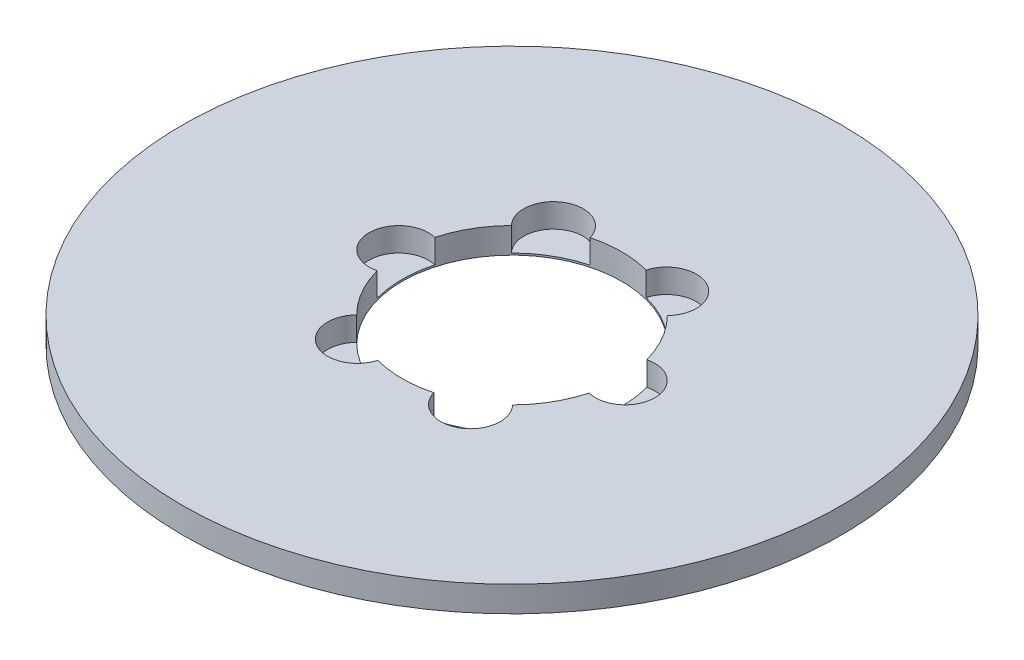
ISO-10303-21;
HEADER;
FILE_DESCRIPTION(('STEP AP214'),'2;1');
FILE_NAME('part.step','',(''),(''),'','','');
FILE_SCHEMA(('AUTOMOTIVE_DESIGN { 1 0 10303 214 1 1 1 1 }'));
ENDSEC;
DATA;
#1=APPLICATION_CONTEXT('core data for automotive mechanical design processes');
#2=APPLICATION_PROTOCOL_DEFINITION('international standard','automotive_design',2000,#1);
#3=PRODUCT_CONTEXT('',#1,'mechanical');
#4=PRODUCT('Part','Part','',(#3));
#5=PRODUCT_RELATED_PRODUCT_CATEGORY('part','',(#4));
#6=PRODUCT_DEFINITION_FORMATION('','',#4);
#7=PRODUCT_DEFINITION_CONTEXT('part definition',#1,'design');
#8=PRODUCT_DEFINITION('design','',#6,#7);
#9=PRODUCT_DEFINITION_SHAPE('','',#8);
#10=(LENGTH_UNIT() NAMED_UNIT(*) SI_UNIT(.MILLI.,.METRE.));
#11=(NAMED_UNIT(*) PLANE_ANGLE_UNIT() SI_UNIT($,.RADIAN.));
#12=(NAMED_UNIT(*) SI_UNIT($,.STERADIAN.) SOLID_ANGLE_UNIT());
#13=UNCERTAINTY_MEASURE_WITH_UNIT(LENGTH_MEASURE(1.E-05),#10,'distance_accuracy_value','');
#14=(GEOMETRIC_REPRESENTATION_CONTEXT(3) GLOBAL_UNCERTAINTY_ASSIGNED_CONTEXT((#13)) GLOBAL_UNIT_ASSIGNED_CONTEXT((#10,
#11,#12)) REPRESENTATION_CONTEXT('',''));
#15=CARTESIAN_POINT('',(0.,0.,0.));
#16=DIRECTION('',(0.,0.,1.));
#17=DIRECTION('',(1.,0.,0.));
#18=AXIS2_PLACEMENT_3D('',#15,#16,#17);
#19=CARTESIAN_POINT('',(0.,7.,0.));
#20=DIRECTION('',(0.,-1.,0.));
#21=DIRECTION('',(0.,0.,-1.));
#22=AXIS2_PLACEMENT_3D('',#19,#20,#21);
#23=CYLINDRICAL_SURFACE('',#22,90.);
#24=CARTESIAN_POINT('',(0.,7.,0.));
#25=DIRECTION('',(0.,1.,0.));
#26=DIRECTION('',(0.,0.,1.));
#27=AXIS2_PLACEMENT_3D('',#24,#25,#26);
#28=CIRCLE('',#27,90.);
#29=CARTESIAN_POINT('',(0.,7.,90.));
#30=VERTEX_POINT('',#29);
#31=EDGE_CURVE('E171',#30,#30,#28,.T.);
#32=ORIENTED_EDGE('',*,*,#31,.F.);
#33=EDGE_LOOP('',(#32));
#34=FACE_BOUND('',#33,.T.);
#35=CARTESIAN_POINT('',(0.,0.,0.));
#36=DIRECTION('',(0.,1.,0.));
#37=DIRECTION('',(0.,0.,1.));
#38=AXIS2_PLACEMENT_3D('',#35,#36,#37);
#39=CIRCLE('',#38,90.);
#40=CARTESIAN_POINT('',(0.,0.,90.));
#41=VERTEX_POINT('',#40);
#42=EDGE_CURVE('E157',#41,#41,#39,.T.);
#43=ORIENTED_EDGE('',*,*,#42,.T.);
#44=EDGE_LOOP('',(#43));
#45=FACE_BOUND('',#44,.T.);
#46=ADVANCED_FACE('F39',(#34,#45),#23,.T.);
#47=CARTESIAN_POINT('',(0.,7.,0.));
#48=DIRECTION('',(0.,1.,0.));
#49=DIRECTION('',(0.,0.,1.));
#50=AXIS2_PLACEMENT_3D('',#47,#48,#49);
#51=PLANE('',#50);
#52=CARTESIAN_POINT('',(-15.4615850806453,7.,-26.7802509252258));
#53=DIRECTION('',(0.,1.,0.));
#54=DIRECTION('',(-0.866025403784433,0.,0.50000000000001));
#55=AXIS2_PLACEMENT_3D('',#52,#53,#54);
#56=CIRCLE('',#55,8.11786884203244);
#57=CARTESIAN_POINT('',(-7.65505944737844,7.,-29.0068968498373));
#58=VERTEX_POINT('',#57);
#59=CARTESIAN_POINT('',(-21.2931798332252,7.,-21.132924373828));
#60=VERTEX_POINT('',#59);
#61=EDGE_CURVE('E214',#58,#60,#56,.T.);
#62=ORIENTED_EDGE('',*,*,#61,.F.);
#63=CARTESIAN_POINT('',(0.,7.,0.));
#64=DIRECTION('',(0.,1.,0.));
#65=DIRECTION('',(0.,0.,1.));
#66=AXIS2_PLACEMENT_3D('',#63,#64,#65);
#67=CIRCLE('',#66,30.);
#68=CARTESIAN_POINT('',(7.65505944737783,7.,-29.0068968498375));
#69=VERTEX_POINT('',#68);
#70=EDGE_CURVE('E272',#69,#58,#67,.T.);
#71=ORIENTED_EDGE('',*,*,#70,.F.);
#72=CARTESIAN_POINT('',(15.4615850806447,7.,-26.7802509252261));
#73=DIRECTION('',(0.,1.,0.));
#74=DIRECTION('',(-0.866025403784443,0.,-0.499999999999992));
#75=AXIS2_PLACEMENT_3D('',#72,#73,#74);
#76=CIRCLE('',#75,8.11786884203244);
#77=CARTESIAN_POINT('',(21.2931798332248,7.,-21.1329243738284));
#78=VERTEX_POINT('',#77);
#79=EDGE_CURVE('E285',#78,#69,#76,.T.);
#80=ORIENTED_EDGE('',*,*,#79,.F.);
#81=CARTESIAN_POINT('',(28.9482392806031,7.,-7.8739724760092));
#82=VERTEX_POINT('',#81);
#83=EDGE_CURVE('E165',#82,#78,#67,.T.);
#84=ORIENTED_EDGE('',*,*,#83,.F.);
#85=CARTESIAN_POINT('',(30.9231701612899,7.,0.));
#86=DIRECTION('',(0.,1.,0.));
#87=DIRECTION('',(0.,0.,-1.));
#88=AXIS2_PLACEMENT_3D('',#85,#86,#87);
#89=CIRCLE('',#88,8.11786884203244);
#90=CARTESIAN_POINT('',(28.9482392806031,7.,7.8739724760092));
#91=VERTEX_POINT('',#90);
#92=EDGE_CURVE('E281',#91,#82,#89,.T.);
#93=ORIENTED_EDGE('',*,*,#92,.F.);
#94=CARTESIAN_POINT('',(21.293179833225,7.,21.1329243738281));
#95=VERTEX_POINT('',#94);
#96=EDGE_CURVE('E160',#95,#91,#67,.T.);
#97=ORIENTED_EDGE('',*,*,#96,.F.);
#98=CARTESIAN_POINT('',(15.4615850806451,7.,26.7802509252259));
#99=DIRECTION('',(0.,1.,0.));
#100=DIRECTION('',(0.866025403784436,0.,-0.500000000000004));
#101=AXIS2_PLACEMENT_3D('',#98,#99,#100);
#102=CIRCLE('',#101,8.11786884203244);
#103=CARTESIAN_POINT('',(7.65505944737824,7.,29.0068968498374));
#104=VERTEX_POINT('',#103);
#105=EDGE_CURVE('E154',#104,#95,#102,.T.);
#106=ORIENTED_EDGE('',*,*,#105,.F.);
#107=CARTESIAN_POINT('',(-7.65505944737803,7.,29.0068968498374));
#108=VERTEX_POINT('',#107);
#109=EDGE_CURVE('E150',#108,#104,#67,.T.);
#110=ORIENTED_EDGE('',*,*,#109,.F.);
#111=CARTESIAN_POINT('',(-15.4615850806449,7.,26.780250925226));
#112=DIRECTION('',(0.,1.,0.));
#113=DIRECTION('',(0.86602540378444,0.,0.499999999999998));
#114=AXIS2_PLACEMENT_3D('',#111,#112,#113);
#115=CIRCLE('',#114,8.11786884203244);
#116=CARTESIAN_POINT('',(-21.2931798332249,7.,21.1329243738283));
#117=VERTEX_POINT('',#116);
#118=EDGE_CURVE('E127',#117,#108,#115,.T.);
#119=ORIENTED_EDGE('',*,*,#118,.F.);
#120=CARTESIAN_POINT('',(-28.9482392806031,7.,7.8739724760092));
#121=VERTEX_POINT('',#120);
#122=EDGE_CURVE('E156',#121,#117,#67,.T.);
#123=ORIENTED_EDGE('',*,*,#122,.F.);
#124=CARTESIAN_POINT('',(-30.9231701612899,7.,0.));
#125=DIRECTION('',(0.,1.,0.));
#126=DIRECTION('',(0.,0.,1.));
#127=AXIS2_PLACEMENT_3D('',#124,#125,#126);
#128=CIRCLE('',#127,8.11786884203244);
#129=CARTESIAN_POINT('',(-28.9482392806031,7.,-7.8739724760092));
#130=VERTEX_POINT('',#129);
#131=EDGE_CURVE('E164',#130,#121,#128,.T.);
#132=ORIENTED_EDGE('',*,*,#131,.F.);
#133=EDGE_CURVE('E159',#60,#130,#67,.T.);
#134=ORIENTED_EDGE('',*,*,#133,.F.);
#135=EDGE_LOOP('',(#62,#71,#80,#84,#93,#97,#106,#110,#119,#123,#132,#134));
#136=FACE_BOUND('',#135,.T.);
#137=ORIENTED_EDGE('',*,*,#31,.T.);
#138=EDGE_LOOP('',(#137));
#139=FACE_BOUND('',#138,.T.);
#140=ADVANCED_FACE('F155',(#136,#139),#51,.T.);
#141=CARTESIAN_POINT('',(0.,0.,0.));
#142=DIRECTION('',(0.,1.,0.));
#143=DIRECTION('',(0.,0.,1.));
#144=AXIS2_PLACEMENT_3D('',#141,#142,#143);
#145=PLANE('',#144);
#146=CARTESIAN_POINT('',(0.,0.,0.));
#147=DIRECTION('',(0.,1.,0.));
#148=DIRECTION('',(0.,0.,1.));
#149=AXIS2_PLACEMENT_3D('',#146,#147,#148);
#150=CIRCLE('',#149,30.);
#151=CARTESIAN_POINT('',(0.,0.,30.));
#152=VERTEX_POINT('',#151);
#153=EDGE_CURVE('E170',#152,#152,#150,.T.);
#154=ORIENTED_EDGE('',*,*,#153,.T.);
#155=EDGE_LOOP('',(#154));
#156=FACE_BOUND('',#155,.T.);
#157=ORIENTED_EDGE('',*,*,#42,.F.);
#158=EDGE_LOOP('',(#157));
#159=FACE_BOUND('',#158,.T.);
#160=ADVANCED_FACE('F232',(#156,#159),#145,.F.);
#161=CARTESIAN_POINT('',(0.,7.,0.));
#162=DIRECTION('',(0.,-1.,0.));
#163=DIRECTION('',(0.,0.,-1.));
#164=AXIS2_PLACEMENT_3D('',#161,#162,#163);
#165=CYLINDRICAL_SURFACE('',#164,30.);
#166=DIRECTION('',(0.,1.,0.));
#167=VECTOR('',#166,1.);
#168=CARTESIAN_POINT('',(-7.65505944737844,3.74736306349018,-29.0068968498373));
#169=LINE('',#168,#167);
#170=CARTESIAN_POINT('',(-7.65505944737844,0.494726126980354,-29.0068968498373));
#171=VERTEX_POINT('',#170);
#172=EDGE_CURVE('E11',#171,#58,#169,.T.);
#173=ORIENTED_EDGE('',*,*,#172,.F.);
#174=CARTESIAN_POINT('',(0.,0.494726126980354,0.));
#175=DIRECTION('',(0.,1.,0.));
#176=DIRECTION('',(0.,0.,1.));
#177=AXIS2_PLACEMENT_3D('',#174,#175,#176);
#178=CIRCLE('',#177,30.);
#179=CARTESIAN_POINT('',(-21.2931798332252,0.494726126980354,-21.132924373828));
#180=VERTEX_POINT('',#179);
#181=EDGE_CURVE('E209',#171,#180,#178,.T.);
#182=ORIENTED_EDGE('',*,*,#181,.T.);
#183=DIRECTION('',(0.,1.,0.));
#184=VECTOR('',#183,1.);
#185=CARTESIAN_POINT('',(-21.2931798332252,3.74736306349018,-21.132924373828));
#186=LINE('',#185,#184);
#187=EDGE_CURVE('E46',#60,#180,#186,.F.);
#188=ORIENTED_EDGE('',*,*,#187,.F.);
#189=ORIENTED_EDGE('',*,*,#133,.T.);
#190=DIRECTION('',(0.,1.,0.));
#191=VECTOR('',#190,1.);
#192=CARTESIAN_POINT('',(-28.9482392806031,3.74736306349018,-7.8739724760092));
#193=LINE('',#192,#191);
#194=CARTESIAN_POINT('',(-28.9482392806031,0.494726126980354,-7.8739724760092));
#195=VERTEX_POINT('',#194);
#196=EDGE_CURVE('E185',#195,#130,#193,.T.);
#197=ORIENTED_EDGE('',*,*,#196,.F.);
#198=CARTESIAN_POINT('',(0.,0.494726126980354,0.));
#199=DIRECTION('',(0.,1.,0.));
#200=DIRECTION('',(0.,0.,1.));
#201=AXIS2_PLACEMENT_3D('',#198,#199,#200);
#202=CIRCLE('',#201,30.);
#203=CARTESIAN_POINT('',(-28.9482392806031,0.494726126980354,7.8739724760092));
#204=VERTEX_POINT('',#203);
#205=EDGE_CURVE('E173',#195,#204,#202,.T.);
#206=ORIENTED_EDGE('',*,*,#205,.T.);
#207=DIRECTION('',(0.,1.,0.));
#208=VECTOR('',#207,1.);
#209=CARTESIAN_POINT('',(-28.9482392806031,3.74736306349018,7.8739724760092));
#210=LINE('',#209,#208);
#211=EDGE_CURVE('E178',#121,#204,#210,.F.);
#212=ORIENTED_EDGE('',*,*,#211,.F.);
#213=ORIENTED_EDGE('',*,*,#122,.T.);
#214=DIRECTION('',(0.,1.,0.));
#215=VECTOR('',#214,1.);
#216=CARTESIAN_POINT('',(-21.2931798332249,3.74736306349018,21.1329243738283));
#217=LINE('',#216,#215);
#218=CARTESIAN_POINT('',(-21.2931798332249,0.494726126980354,21.1329243738283));
#219=VERTEX_POINT('',#218);
#220=EDGE_CURVE('E132',#219,#117,#217,.T.);
#221=ORIENTED_EDGE('',*,*,#220,.F.);
#222=CARTESIAN_POINT('',(0.,0.494726126980354,0.));
#223=DIRECTION('',(0.,1.,0.));
#224=DIRECTION('',(0.,0.,1.));
#225=AXIS2_PLACEMENT_3D('',#222,#223,#224);
#226=CIRCLE('',#225,30.);
#227=CARTESIAN_POINT('',(-7.65505944737803,0.494726126980354,29.0068968498374));
#228=VERTEX_POINT('',#227);
#229=EDGE_CURVE('E146',#219,#228,#226,.T.);
#230=ORIENTED_EDGE('',*,*,#229,.T.);
#231=DIRECTION('',(0.,1.,0.));
#232=VECTOR('',#231,1.);
#233=CARTESIAN_POINT('',(-7.65505944737803,3.74736306349018,29.0068968498374));
#234=LINE('',#233,#232);
#235=EDGE_CURVE('E128',#108,#228,#234,.F.);
#236=ORIENTED_EDGE('',*,*,#235,.F.);
#237=ORIENTED_EDGE('',*,*,#109,.T.);
#238=DIRECTION('',(0.,1.,0.));
#239=VECTOR('',#238,1.);
#240=CARTESIAN_POINT('',(7.65505944737824,3.74736306349018,29.0068968498374));
#241=LINE('',#240,#239);
#242=CARTESIAN_POINT('',(7.65505944737824,0.494726126980354,29.0068968498374));
#243=VERTEX_POINT('',#242);
#244=EDGE_CURVE('E192',#243,#104,#241,.T.);
#245=ORIENTED_EDGE('',*,*,#244,.F.);
#246=CARTESIAN_POINT('',(0.,0.494726126980354,0.));
#247=DIRECTION('',(0.,1.,0.));
#248=DIRECTION('',(0.,0.,1.));
#249=AXIS2_PLACEMENT_3D('',#246,#247,#248);
#250=CIRCLE('',#249,30.);
#251=CARTESIAN_POINT('',(21.293179833225,0.494726126980354,21.1329243738281));
#252=VERTEX_POINT('',#251);
#253=EDGE_CURVE('E190',#243,#252,#250,.T.);
#254=ORIENTED_EDGE('',*,*,#253,.T.);
#255=DIRECTION('',(0.,1.,0.));
#256=VECTOR('',#255,1.);
#257=CARTESIAN_POINT('',(21.293179833225,3.74736306349018,21.1329243738281));
#258=LINE('',#257,#256);
#259=EDGE_CURVE('E189',#95,#252,#258,.F.);
#260=ORIENTED_EDGE('',*,*,#259,.F.);
#261=ORIENTED_EDGE('',*,*,#96,.T.);
#262=DIRECTION('',(0.,1.,0.));
#263=VECTOR('',#262,1.);
#264=CARTESIAN_POINT('',(28.9482392806031,3.74736306349018,7.8739724760092));
#265=LINE('',#264,#263);
#266=CARTESIAN_POINT('',(28.9482392806031,0.494726126980354,7.8739724760092));
#267=VERTEX_POINT('',#266);
#268=EDGE_CURVE('E203',#267,#91,#265,.T.);
#269=ORIENTED_EDGE('',*,*,#268,.F.);
#270=CARTESIAN_POINT('',(0.,0.494726126980354,0.));
#271=DIRECTION('',(0.,1.,0.));
#272=DIRECTION('',(0.,0.,1.));
#273=AXIS2_PLACEMENT_3D('',#270,#271,#272);
#274=CIRCLE('',#273,30.);
#275=CARTESIAN_POINT('',(28.9482392806031,0.494726126980354,-7.8739724760092));
#276=VERTEX_POINT('',#275);
#277=EDGE_CURVE('E194',#267,#276,#274,.T.);
#278=ORIENTED_EDGE('',*,*,#277,.T.);
#279=DIRECTION('',(0.,1.,0.));
#280=VECTOR('',#279,1.);
#281=CARTESIAN_POINT('',(28.9482392806031,3.74736306349018,-7.8739724760092));
#282=LINE('',#281,#280);
#283=EDGE_CURVE('E196',#82,#276,#282,.F.);
#284=ORIENTED_EDGE('',*,*,#283,.F.);
#285=ORIENTED_EDGE('',*,*,#83,.T.);
#286=DIRECTION('',(0.,1.,0.));
#287=VECTOR('',#286,1.);
#288=CARTESIAN_POINT('',(21.2931798332248,3.74736306349018,-21.1329243738284));
#289=LINE('',#288,#287);
#290=CARTESIAN_POINT('',(21.2931798332248,0.494726126980354,-21.1329243738284));
#291=VERTEX_POINT('',#290);
#292=EDGE_CURVE('E208',#291,#78,#289,.T.);
#293=ORIENTED_EDGE('',*,*,#292,.F.);
#294=CARTESIAN_POINT('',(0.,0.494726126980354,0.));
#295=DIRECTION('',(0.,1.,0.));
#296=DIRECTION('',(0.,0.,1.));
#297=AXIS2_PLACEMENT_3D('',#294,#295,#296);
#298=CIRCLE('',#297,30.);
#299=CARTESIAN_POINT('',(7.65505944737783,0.494726126980354,-29.0068968498375));
#300=VERTEX_POINT('',#299);
#301=EDGE_CURVE('E201',#291,#300,#298,.T.);
#302=ORIENTED_EDGE('',*,*,#301,.T.);
#303=DIRECTION('',(0.,1.,0.));
#304=VECTOR('',#303,1.);
#305=CARTESIAN_POINT('',(7.65505944737783,3.74736306349018,-29.0068968498375));
#306=LINE('',#305,#304);
#307=EDGE_CURVE('E206',#69,#300,#306,.F.);
#308=ORIENTED_EDGE('',*,*,#307,.F.);
#309=ORIENTED_EDGE('',*,*,#70,.T.);
#310=EDGE_LOOP('',(#173,#182,#188,#189,#197,#206,#212,#213,#221,#230,#236,#237,#245,#254,#260,
#261,#269,#278,#284,#285,#293,#302,#308,#309));
#311=FACE_BOUND('',#310,.T.);
#312=ORIENTED_EDGE('',*,*,#153,.F.);
#313=EDGE_LOOP('',(#312));
#314=FACE_BOUND('',#313,.T.);
#315=ADVANCED_FACE('F145',(#311,#314),#165,.F.);
#316=CARTESIAN_POINT('',(-30.9231701612899,0.494726126980354,0.));
#317=DIRECTION('',(0.,1.,0.));
#318=DIRECTION('',(0.,0.,1.));
#319=AXIS2_PLACEMENT_3D('',#316,#317,#318);
#320=CYLINDRICAL_SURFACE('',#319,8.11786884203244);
#321=ORIENTED_EDGE('',*,*,#196,.T.);
#322=ORIENTED_EDGE('',*,*,#131,.T.);
#323=ORIENTED_EDGE('',*,*,#211,.T.);
#324=CARTESIAN_POINT('',(-30.9231701612899,0.494726126980354,0.));
#325=DIRECTION('',(0.,1.,0.));
#326=DIRECTION('',(0.,0.,1.));
#327=AXIS2_PLACEMENT_3D('',#324,#325,#326);
#328=CIRCLE('',#327,8.11786884203244);
#329=EDGE_CURVE('E168',#195,#204,#328,.T.);
#330=ORIENTED_EDGE('',*,*,#329,.F.);
#331=EDGE_LOOP('',(#321,#322,#323,#330));
#332=FACE_BOUND('',#331,.T.);
#333=ADVANCED_FACE('F243',(#332),#320,.F.);
#334=CARTESIAN_POINT('',(-30.9231701612899,0.494726126980354,0.));
#335=DIRECTION('',(0.,1.,0.));
#336=DIRECTION('',(0.,0.,1.));
#337=AXIS2_PLACEMENT_3D('',#334,#335,#336);
#338=PLANE('',#337);
#339=ORIENTED_EDGE('',*,*,#329,.T.);
#340=ORIENTED_EDGE('',*,*,#205,.F.);
#341=EDGE_LOOP('',(#339,#340));
#342=FACE_BOUND('',#341,.T.);
#343=ADVANCED_FACE('F247',(#342),#338,.T.);
#344=CARTESIAN_POINT('',(-15.4615850806449,0.494726126980354,26.780250925226));
#345=DIRECTION('',(0.,1.,0.));
#346=DIRECTION('',(0.,0.,1.));
#347=AXIS2_PLACEMENT_3D('',#344,#345,#346);
#348=CYLINDRICAL_SURFACE('',#347,8.11786884203244);
#349=ORIENTED_EDGE('',*,*,#220,.T.);
#350=ORIENTED_EDGE('',*,*,#118,.T.);
#351=ORIENTED_EDGE('',*,*,#235,.T.);
#352=CARTESIAN_POINT('',(-15.4615850806449,0.494726126980354,26.780250925226));
#353=DIRECTION('',(0.,1.,0.));
#354=DIRECTION('',(0.86602540378444,0.,0.499999999999998));
#355=AXIS2_PLACEMENT_3D('',#352,#353,#354);
#356=CIRCLE('',#355,8.11786884203244);
#357=EDGE_CURVE('E137',#219,#228,#356,.T.);
#358=ORIENTED_EDGE('',*,*,#357,.F.);
#359=EDGE_LOOP('',(#349,#350,#351,#358));
#360=FACE_BOUND('',#359,.T.);
#361=ADVANCED_FACE('F126',(#360),#348,.F.);
#362=CARTESIAN_POINT('',(-15.4615850806449,0.494726126980354,26.780250925226));
#363=DIRECTION('',(0.,1.,0.));
#364=DIRECTION('',(0.86602540378444,0.,0.499999999999998));
#365=AXIS2_PLACEMENT_3D('',#362,#363,#364);
#366=PLANE('',#365);
#367=ORIENTED_EDGE('',*,*,#357,.T.);
#368=ORIENTED_EDGE('',*,*,#229,.F.);
#369=EDGE_LOOP('',(#367,#368));
#370=FACE_BOUND('',#369,.T.);
#371=ADVANCED_FACE('F254',(#370),#366,.T.);
#372=CARTESIAN_POINT('',(15.4615850806451,0.494726126980354,26.7802509252259));
#373=DIRECTION('',(0.,1.,0.));
#374=DIRECTION('',(0.,0.,1.));
#375=AXIS2_PLACEMENT_3D('',#372,#373,#374);
#376=CYLINDRICAL_SURFACE('',#375,8.11786884203244);
#377=ORIENTED_EDGE('',*,*,#244,.T.);
#378=ORIENTED_EDGE('',*,*,#105,.T.);
#379=ORIENTED_EDGE('',*,*,#259,.T.);
#380=CARTESIAN_POINT('',(15.4615850806451,0.494726126980354,26.7802509252259));
#381=DIRECTION('',(0.,1.,0.));
#382=DIRECTION('',(0.866025403784436,0.,-0.500000000000004));
#383=AXIS2_PLACEMENT_3D('',#380,#381,#382);
#384=CIRCLE('',#383,8.11786884203244);
#385=EDGE_CURVE('E138',#243,#252,#384,.T.);
#386=ORIENTED_EDGE('',*,*,#385,.F.);
#387=EDGE_LOOP('',(#377,#378,#379,#386));
#388=FACE_BOUND('',#387,.T.);
#389=ADVANCED_FACE('F260',(#388),#376,.F.);
#390=CARTESIAN_POINT('',(15.4615850806451,0.494726126980354,26.7802509252259));
#391=DIRECTION('',(0.,1.,0.));
#392=DIRECTION('',(0.866025403784436,0.,-0.500000000000004));
#393=AXIS2_PLACEMENT_3D('',#390,#391,#392);
#394=PLANE('',#393);
#395=ORIENTED_EDGE('',*,*,#385,.T.);
#396=ORIENTED_EDGE('',*,*,#253,.F.);
#397=EDGE_LOOP('',(#395,#396));
#398=FACE_BOUND('',#397,.T.);
#399=ADVANCED_FACE('F265',(#398),#394,.T.);
#400=CARTESIAN_POINT('',(30.9231701612899,0.494726126980354,0.));
#401=DIRECTION('',(0.,1.,0.));
#402=DIRECTION('',(0.,0.,1.));
#403=AXIS2_PLACEMENT_3D('',#400,#401,#402);
#404=CYLINDRICAL_SURFACE('',#403,8.11786884203244);
#405=ORIENTED_EDGE('',*,*,#268,.T.);
#406=ORIENTED_EDGE('',*,*,#92,.T.);
#407=ORIENTED_EDGE('',*,*,#283,.T.);
#408=CARTESIAN_POINT('',(30.9231701612899,0.494726126980354,0.));
#409=DIRECTION('',(0.,1.,0.));
#410=DIRECTION('',(0.,0.,-1.));
#411=AXIS2_PLACEMENT_3D('',#408,#409,#410);
#412=CIRCLE('',#411,8.11786884203244);
#413=EDGE_CURVE('E287',#267,#276,#412,.T.);
#414=ORIENTED_EDGE('',*,*,#413,.F.);
#415=EDGE_LOOP('',(#405,#406,#407,#414));
#416=FACE_BOUND('',#415,.T.);
#417=ADVANCED_FACE('F300',(#416),#404,.F.);
#418=CARTESIAN_POINT('',(30.9231701612899,0.494726126980354,0.));
#419=DIRECTION('',(0.,1.,0.));
#420=DIRECTION('',(0.,0.,-1.));
#421=AXIS2_PLACEMENT_3D('',#418,#419,#420);
#422=PLANE('',#421);
#423=ORIENTED_EDGE('',*,*,#413,.T.);
#424=ORIENTED_EDGE('',*,*,#277,.F.);
#425=EDGE_LOOP('',(#423,#424));
#426=FACE_BOUND('',#425,.T.);
#427=ADVANCED_FACE('F298',(#426),#422,.T.);
#428=CARTESIAN_POINT('',(15.4615850806447,0.494726126980354,-26.7802509252261));
#429=DIRECTION('',(0.,1.,0.));
#430=DIRECTION('',(0.,0.,1.));
#431=AXIS2_PLACEMENT_3D('',#428,#429,#430);
#432=CYLINDRICAL_SURFACE('',#431,8.11786884203244);
#433=ORIENTED_EDGE('',*,*,#292,.T.);
#434=ORIENTED_EDGE('',*,*,#79,.T.);
#435=ORIENTED_EDGE('',*,*,#307,.T.);
#436=CARTESIAN_POINT('',(15.4615850806447,0.494726126980354,-26.7802509252261));
#437=DIRECTION('',(0.,1.,0.));
#438=DIRECTION('',(-0.866025403784443,0.,-0.499999999999992));
#439=AXIS2_PLACEMENT_3D('',#436,#437,#438);
#440=CIRCLE('',#439,8.11786884203244);
#441=EDGE_CURVE('E56',#291,#300,#440,.T.);
#442=ORIENTED_EDGE('',*,*,#441,.F.);
#443=EDGE_LOOP('',(#433,#434,#435,#442));
#444=FACE_BOUND('',#443,.T.);
#445=ADVANCED_FACE('F301',(#444),#432,.F.);
#446=CARTESIAN_POINT('',(15.4615850806447,0.494726126980354,-26.7802509252261));
#447=DIRECTION('',(0.,1.,0.));
#448=DIRECTION('',(-0.866025403784443,0.,-0.499999999999992));
#449=AXIS2_PLACEMENT_3D('',#446,#447,#448);
#450=PLANE('',#449);
#451=ORIENTED_EDGE('',*,*,#441,.T.);
#452=ORIENTED_EDGE('',*,*,#301,.F.);
#453=EDGE_LOOP('',(#451,#452));
#454=FACE_BOUND('',#453,.T.);
#455=ADVANCED_FACE('F221',(#454),#450,.T.);
#456=CARTESIAN_POINT('',(-15.4615850806453,0.494726126980354,-26.7802509252258));
#457=DIRECTION('',(0.,1.,0.));
#458=DIRECTION('',(0.,0.,1.));
#459=AXIS2_PLACEMENT_3D('',#456,#457,#458);
#460=CYLINDRICAL_SURFACE('',#459,8.11786884203244);
#461=ORIENTED_EDGE('',*,*,#172,.T.);
#462=ORIENTED_EDGE('',*,*,#61,.T.);
#463=ORIENTED_EDGE('',*,*,#187,.T.);
#464=CARTESIAN_POINT('',(-15.4615850806453,0.494726126980354,-26.7802509252258));
#465=DIRECTION('',(0.,1.,0.));
#466=DIRECTION('',(-0.866025403784433,0.,0.50000000000001));
#467=AXIS2_PLACEMENT_3D('',#464,#465,#466);
#468=CIRCLE('',#467,8.11786884203244);
#469=EDGE_CURVE('E55',#171,#180,#468,.T.);
#470=ORIENTED_EDGE('',*,*,#469,.F.);
#471=EDGE_LOOP('',(#461,#462,#463,#470));
#472=FACE_BOUND('',#471,.T.);
#473=ADVANCED_FACE('F212',(#472),#460,.F.);
#474=CARTESIAN_POINT('',(-15.4615850806453,0.494726126980354,-26.7802509252258));
#475=DIRECTION('',(0.,1.,0.));
#476=DIRECTION('',(-0.866025403784433,0.,0.50000000000001));
#477=AXIS2_PLACEMENT_3D('',#474,#475,#476);
#478=PLANE('',#477);
#479=ORIENTED_EDGE('',*,*,#469,.T.);
#480=ORIENTED_EDGE('',*,*,#181,.F.);
#481=EDGE_LOOP('',(#479,#480));
#482=FACE_BOUND('',#481,.T.);
#483=ADVANCED_FACE('F217',(#482),#478,.T.);
#484=CLOSED_SHELL('',(#46,#140,#160,#315,#333,#343,#361,#371,#389,#399,#417,#427,#445,#455,#473,#483));
#485=MANIFOLD_SOLID_BREP('B2',#484);
#486=ADVANCED_BREP_SHAPE_REPRESENTATION('',(#18,#485),#14);
#487=SHAPE_DEFINITION_REPRESENTATION(#9,#486);
ENDSEC;
END-ISO-10303-21;
